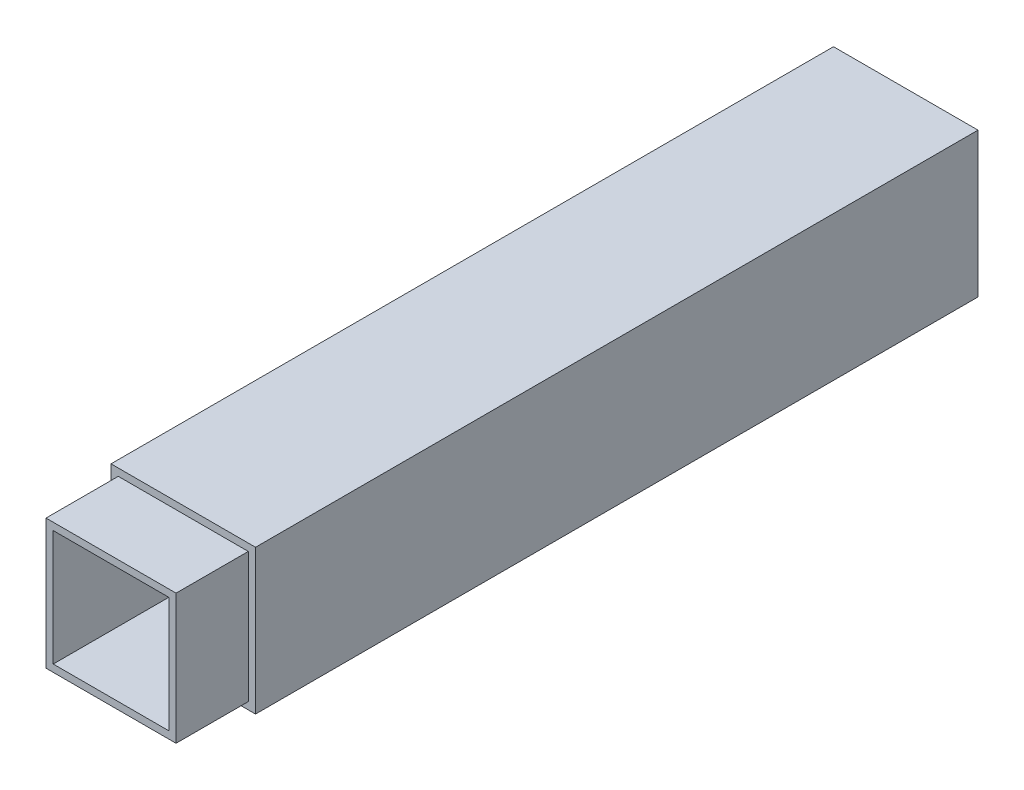
ISO-10303-21;
HEADER;
FILE_DESCRIPTION(('STEP AP214'),'2;1');
FILE_NAME('part.step','',(''),(''),'','','');
FILE_SCHEMA(('AUTOMOTIVE_DESIGN { 1 0 10303 214 1 1 1 1 }'));
ENDSEC;
DATA;
#1=APPLICATION_CONTEXT('core data for automotive mechanical design processes');
#2=APPLICATION_PROTOCOL_DEFINITION('international standard','automotive_design',2000,#1);
#3=PRODUCT_CONTEXT('',#1,'mechanical');
#4=PRODUCT('Part','Part','',(#3));
#5=PRODUCT_RELATED_PRODUCT_CATEGORY('part','',(#4));
#6=PRODUCT_DEFINITION_FORMATION('','',#4);
#7=PRODUCT_DEFINITION_CONTEXT('part definition',#1,'design');
#8=PRODUCT_DEFINITION('design','',#6,#7);
#9=PRODUCT_DEFINITION_SHAPE('','',#8);
#10=(LENGTH_UNIT() NAMED_UNIT(*) SI_UNIT(.MILLI.,.METRE.));
#11=(NAMED_UNIT(*) PLANE_ANGLE_UNIT() SI_UNIT($,.RADIAN.));
#12=(NAMED_UNIT(*) SI_UNIT($,.STERADIAN.) SOLID_ANGLE_UNIT());
#13=UNCERTAINTY_MEASURE_WITH_UNIT(LENGTH_MEASURE(1.E-05),#10,'distance_accuracy_value','');
#14=(GEOMETRIC_REPRESENTATION_CONTEXT(3) GLOBAL_UNCERTAINTY_ASSIGNED_CONTEXT((#13)) GLOBAL_UNIT_ASSIGNED_CONTEXT((#10,
#11,#12)) REPRESENTATION_CONTEXT('',''));
#15=CARTESIAN_POINT('',(0.,0.,0.));
#16=DIRECTION('',(0.,0.,1.));
#17=DIRECTION('',(1.,0.,0.));
#18=AXIS2_PLACEMENT_3D('',#15,#16,#17);
#19=CARTESIAN_POINT('',(-10.,10.,100.));
#20=DIRECTION('',(1.,0.,0.));
#21=DIRECTION('',(0.,1.,0.));
#22=AXIS2_PLACEMENT_3D('',#19,#20,#21);
#23=PLANE('',#22);
#24=DIRECTION('',(0.,-1.,0.));
#25=VECTOR('',#24,1.);
#26=CARTESIAN_POINT('',(-10.,10.,0.));
#27=LINE('',#26,#25);
#28=CARTESIAN_POINT('',(-10.,10.,0.));
#29=VERTEX_POINT('',#28);
#30=CARTESIAN_POINT('',(-10.,-10.,0.));
#31=VERTEX_POINT('',#30);
#32=EDGE_CURVE('E220',#29,#31,#27,.T.);
#33=ORIENTED_EDGE('',*,*,#32,.T.);
#34=DIRECTION('',(0.,0.,-1.));
#35=VECTOR('',#34,1.);
#36=CARTESIAN_POINT('',(-10.,-10.,100.));
#37=LINE('',#36,#35);
#38=CARTESIAN_POINT('',(-10.,-10.,100.));
#39=VERTEX_POINT('',#38);
#40=EDGE_CURVE('E11',#39,#31,#37,.T.);
#41=ORIENTED_EDGE('',*,*,#40,.F.);
#42=DIRECTION('',(0.,-1.,0.));
#43=VECTOR('',#42,1.);
#44=CARTESIAN_POINT('',(-10.,10.,100.));
#45=LINE('',#44,#43);
#46=CARTESIAN_POINT('',(-10.,10.,100.));
#47=VERTEX_POINT('',#46);
#48=EDGE_CURVE('E221',#47,#39,#45,.T.);
#49=ORIENTED_EDGE('',*,*,#48,.F.);
#50=DIRECTION('',(0.,0.,-1.));
#51=VECTOR('',#50,1.);
#52=CARTESIAN_POINT('',(-10.,10.,100.));
#53=LINE('',#52,#51);
#54=EDGE_CURVE('E235',#47,#29,#53,.T.);
#55=ORIENTED_EDGE('',*,*,#54,.T.);
#56=EDGE_LOOP('',(#33,#41,#49,#55));
#57=FACE_BOUND('',#56,.T.);
#58=ADVANCED_FACE('F39',(#57),#23,.F.);
#59=CARTESIAN_POINT('',(-10.,-10.,100.));
#60=DIRECTION('',(0.,1.,0.));
#61=DIRECTION('',(0.,0.,1.));
#62=AXIS2_PLACEMENT_3D('',#59,#60,#61);
#63=PLANE('',#62);
#64=DIRECTION('',(1.,0.,0.));
#65=VECTOR('',#64,1.);
#66=CARTESIAN_POINT('',(-10.,-10.,0.));
#67=LINE('',#66,#65);
#68=CARTESIAN_POINT('',(10.,-10.,0.));
#69=VERTEX_POINT('',#68);
#70=EDGE_CURVE('E239',#31,#69,#67,.T.);
#71=ORIENTED_EDGE('',*,*,#70,.T.);
#72=DIRECTION('',(0.,0.,-1.));
#73=VECTOR('',#72,1.);
#74=CARTESIAN_POINT('',(10.,-10.,100.));
#75=LINE('',#74,#73);
#76=CARTESIAN_POINT('',(10.,-10.,100.));
#77=VERTEX_POINT('',#76);
#78=EDGE_CURVE('E47',#77,#69,#75,.T.);
#79=ORIENTED_EDGE('',*,*,#78,.F.);
#80=DIRECTION('',(1.,0.,0.));
#81=VECTOR('',#80,1.);
#82=CARTESIAN_POINT('',(-10.,-10.,100.));
#83=LINE('',#82,#81);
#84=EDGE_CURVE('E225',#39,#77,#83,.T.);
#85=ORIENTED_EDGE('',*,*,#84,.F.);
#86=ORIENTED_EDGE('',*,*,#40,.T.);
#87=EDGE_LOOP('',(#71,#79,#85,#86));
#88=FACE_BOUND('',#87,.T.);
#89=ADVANCED_FACE('F275',(#88),#63,.F.);
#90=CARTESIAN_POINT('',(10.,10.,100.));
#91=DIRECTION('',(-1.,0.,0.));
#92=DIRECTION('',(0.,-1.,0.));
#93=AXIS2_PLACEMENT_3D('',#90,#91,#92);
#94=PLANE('',#93);
#95=DIRECTION('',(0.,1.,0.));
#96=VECTOR('',#95,1.);
#97=CARTESIAN_POINT('',(10.,10.,0.));
#98=LINE('',#97,#96);
#99=CARTESIAN_POINT('',(10.,10.,0.));
#100=VERTEX_POINT('',#99);
#101=EDGE_CURVE('E242',#69,#100,#98,.T.);
#102=ORIENTED_EDGE('',*,*,#101,.T.);
#103=DIRECTION('',(0.,0.,-1.));
#104=VECTOR('',#103,1.);
#105=CARTESIAN_POINT('',(10.,10.,100.));
#106=LINE('',#105,#104);
#107=CARTESIAN_POINT('',(10.,10.,100.));
#108=VERTEX_POINT('',#107);
#109=EDGE_CURVE('E250',#108,#100,#106,.T.);
#110=ORIENTED_EDGE('',*,*,#109,.F.);
#111=DIRECTION('',(0.,1.,0.));
#112=VECTOR('',#111,1.);
#113=CARTESIAN_POINT('',(10.,10.,100.));
#114=LINE('',#113,#112);
#115=EDGE_CURVE('E229',#77,#108,#114,.T.);
#116=ORIENTED_EDGE('',*,*,#115,.F.);
#117=ORIENTED_EDGE('',*,*,#78,.T.);
#118=EDGE_LOOP('',(#102,#110,#116,#117));
#119=FACE_BOUND('',#118,.T.);
#120=ADVANCED_FACE('F259',(#119),#94,.F.);
#121=CARTESIAN_POINT('',(-10.,10.,100.));
#122=DIRECTION('',(0.,-1.,0.));
#123=DIRECTION('',(0.,0.,-1.));
#124=AXIS2_PLACEMENT_3D('',#121,#122,#123);
#125=PLANE('',#124);
#126=DIRECTION('',(-1.,0.,0.));
#127=VECTOR('',#126,1.);
#128=CARTESIAN_POINT('',(-10.,10.,0.));
#129=LINE('',#128,#127);
#130=EDGE_CURVE('E226',#100,#29,#129,.T.);
#131=ORIENTED_EDGE('',*,*,#130,.T.);
#132=ORIENTED_EDGE('',*,*,#54,.F.);
#133=DIRECTION('',(-1.,0.,0.));
#134=VECTOR('',#133,1.);
#135=CARTESIAN_POINT('',(-10.,10.,100.));
#136=LINE('',#135,#134);
#137=EDGE_CURVE('E232',#108,#47,#136,.T.);
#138=ORIENTED_EDGE('',*,*,#137,.F.);
#139=ORIENTED_EDGE('',*,*,#109,.T.);
#140=EDGE_LOOP('',(#131,#132,#138,#139));
#141=FACE_BOUND('',#140,.T.);
#142=ADVANCED_FACE('F268',(#141),#125,.F.);
#143=CARTESIAN_POINT('',(0.,0.,100.));
#144=DIRECTION('',(0.,0.,1.));
#145=DIRECTION('',(1.,0.,0.));
#146=AXIS2_PLACEMENT_3D('',#143,#144,#145);
#147=PLANE('',#146);
#148=DIRECTION('',(0.,-1.,0.));
#149=VECTOR('',#148,1.);
#150=CARTESIAN_POINT('',(-9.,9.,100.));
#151=LINE('',#150,#149);
#152=CARTESIAN_POINT('',(-9.,9.,100.));
#153=VERTEX_POINT('',#152);
#154=CARTESIAN_POINT('',(-9.,-9.,100.));
#155=VERTEX_POINT('',#154);
#156=EDGE_CURVE('E62',#153,#155,#151,.T.);
#157=ORIENTED_EDGE('',*,*,#156,.F.);
#158=DIRECTION('',(-1.,0.,0.));
#159=VECTOR('',#158,1.);
#160=CARTESIAN_POINT('',(-9.,9.,100.));
#161=LINE('',#160,#159);
#162=CARTESIAN_POINT('',(9.,9.,100.));
#163=VERTEX_POINT('',#162);
#164=EDGE_CURVE('E183',#163,#153,#161,.T.);
#165=ORIENTED_EDGE('',*,*,#164,.F.);
#166=DIRECTION('',(0.,1.,0.));
#167=VECTOR('',#166,1.);
#168=CARTESIAN_POINT('',(9.,9.,100.));
#169=LINE('',#168,#167);
#170=CARTESIAN_POINT('',(9.,-9.,100.));
#171=VERTEX_POINT('',#170);
#172=EDGE_CURVE('E199',#171,#163,#169,.T.);
#173=ORIENTED_EDGE('',*,*,#172,.F.);
#174=DIRECTION('',(1.,0.,0.));
#175=VECTOR('',#174,1.);
#176=CARTESIAN_POINT('',(-9.,-9.,100.));
#177=LINE('',#176,#175);
#178=EDGE_CURVE('E195',#155,#171,#177,.T.);
#179=ORIENTED_EDGE('',*,*,#178,.F.);
#180=EDGE_LOOP('',(#157,#165,#173,#179));
#181=FACE_BOUND('',#180,.T.);
#182=ORIENTED_EDGE('',*,*,#48,.T.);
#183=ORIENTED_EDGE('',*,*,#84,.T.);
#184=ORIENTED_EDGE('',*,*,#115,.T.);
#185=ORIENTED_EDGE('',*,*,#137,.T.);
#186=EDGE_LOOP('',(#182,#183,#184,#185));
#187=FACE_BOUND('',#186,.T.);
#188=ADVANCED_FACE('F274',(#181,#187),#147,.T.);
#189=CARTESIAN_POINT('',(0.,0.,0.));
#190=DIRECTION('',(0.,0.,1.));
#191=DIRECTION('',(1.,0.,0.));
#192=AXIS2_PLACEMENT_3D('',#189,#190,#191);
#193=PLANE('',#192);
#194=ORIENTED_EDGE('',*,*,#32,.F.);
#195=ORIENTED_EDGE('',*,*,#130,.F.);
#196=ORIENTED_EDGE('',*,*,#101,.F.);
#197=ORIENTED_EDGE('',*,*,#70,.F.);
#198=EDGE_LOOP('',(#194,#195,#196,#197));
#199=FACE_BOUND('',#198,.T.);
#200=ADVANCED_FACE('F265',(#199),#193,.F.);
#201=CARTESIAN_POINT('',(-9.,9.,110.));
#202=DIRECTION('',(1.,0.,0.));
#203=DIRECTION('',(0.,1.,0.));
#204=AXIS2_PLACEMENT_3D('',#201,#202,#203);
#205=PLANE('',#204);
#206=ORIENTED_EDGE('',*,*,#156,.T.);
#207=DIRECTION('',(0.,0.,-1.));
#208=VECTOR('',#207,1.);
#209=CARTESIAN_POINT('',(-9.,-9.,110.));
#210=LINE('',#209,#208);
#211=CARTESIAN_POINT('',(-9.,-9.,110.));
#212=VERTEX_POINT('',#211);
#213=EDGE_CURVE('E216',#212,#155,#210,.T.);
#214=ORIENTED_EDGE('',*,*,#213,.F.);
#215=DIRECTION('',(0.,-1.,0.));
#216=VECTOR('',#215,1.);
#217=CARTESIAN_POINT('',(-9.,9.,110.));
#218=LINE('',#217,#216);
#219=CARTESIAN_POINT('',(-9.,9.,110.));
#220=VERTEX_POINT('',#219);
#221=EDGE_CURVE('E178',#220,#212,#218,.T.);
#222=ORIENTED_EDGE('',*,*,#221,.F.);
#223=DIRECTION('',(0.,0.,-1.));
#224=VECTOR('',#223,1.);
#225=CARTESIAN_POINT('',(-9.,9.,110.));
#226=LINE('',#225,#224);
#227=EDGE_CURVE('E192',#220,#153,#226,.T.);
#228=ORIENTED_EDGE('',*,*,#227,.T.);
#229=EDGE_LOOP('',(#206,#214,#222,#228));
#230=FACE_BOUND('',#229,.T.);
#231=ADVANCED_FACE('F287',(#230),#205,.F.);
#232=CARTESIAN_POINT('',(-9.,-9.,110.));
#233=DIRECTION('',(0.,1.,0.));
#234=DIRECTION('',(0.,0.,1.));
#235=AXIS2_PLACEMENT_3D('',#232,#233,#234);
#236=PLANE('',#235);
#237=ORIENTED_EDGE('',*,*,#178,.T.);
#238=DIRECTION('',(0.,0.,-1.));
#239=VECTOR('',#238,1.);
#240=CARTESIAN_POINT('',(9.,-9.,110.));
#241=LINE('',#240,#239);
#242=CARTESIAN_POINT('',(9.,-9.,110.));
#243=VERTEX_POINT('',#242);
#244=EDGE_CURVE('E212',#243,#171,#241,.T.);
#245=ORIENTED_EDGE('',*,*,#244,.F.);
#246=DIRECTION('',(1.,0.,0.));
#247=VECTOR('',#246,1.);
#248=CARTESIAN_POINT('',(-9.,-9.,110.));
#249=LINE('',#248,#247);
#250=EDGE_CURVE('E182',#212,#243,#249,.T.);
#251=ORIENTED_EDGE('',*,*,#250,.F.);
#252=ORIENTED_EDGE('',*,*,#213,.T.);
#253=EDGE_LOOP('',(#237,#245,#251,#252));
#254=FACE_BOUND('',#253,.T.);
#255=ADVANCED_FACE('F292',(#254),#236,.F.);
#256=CARTESIAN_POINT('',(9.,9.,110.));
#257=DIRECTION('',(-1.,0.,0.));
#258=DIRECTION('',(0.,-1.,0.));
#259=AXIS2_PLACEMENT_3D('',#256,#257,#258);
#260=PLANE('',#259);
#261=ORIENTED_EDGE('',*,*,#172,.T.);
#262=DIRECTION('',(0.,0.,-1.));
#263=VECTOR('',#262,1.);
#264=CARTESIAN_POINT('',(9.,9.,110.));
#265=LINE('',#264,#263);
#266=CARTESIAN_POINT('',(9.,9.,110.));
#267=VERTEX_POINT('',#266);
#268=EDGE_CURVE('E208',#267,#163,#265,.T.);
#269=ORIENTED_EDGE('',*,*,#268,.F.);
#270=DIRECTION('',(0.,1.,0.));
#271=VECTOR('',#270,1.);
#272=CARTESIAN_POINT('',(9.,9.,110.));
#273=LINE('',#272,#271);
#274=EDGE_CURVE('E186',#243,#267,#273,.T.);
#275=ORIENTED_EDGE('',*,*,#274,.F.);
#276=ORIENTED_EDGE('',*,*,#244,.T.);
#277=EDGE_LOOP('',(#261,#269,#275,#276));
#278=FACE_BOUND('',#277,.T.);
#279=ADVANCED_FACE('F296',(#278),#260,.F.);
#280=CARTESIAN_POINT('',(-9.,9.,110.));
#281=DIRECTION('',(0.,-1.,0.));
#282=DIRECTION('',(0.,0.,-1.));
#283=AXIS2_PLACEMENT_3D('',#280,#281,#282);
#284=PLANE('',#283);
#285=ORIENTED_EDGE('',*,*,#164,.T.);
#286=ORIENTED_EDGE('',*,*,#227,.F.);
#287=DIRECTION('',(-1.,0.,0.));
#288=VECTOR('',#287,1.);
#289=CARTESIAN_POINT('',(-9.,9.,110.));
#290=LINE('',#289,#288);
#291=EDGE_CURVE('E189',#267,#220,#290,.T.);
#292=ORIENTED_EDGE('',*,*,#291,.F.);
#293=ORIENTED_EDGE('',*,*,#268,.T.);
#294=EDGE_LOOP('',(#285,#286,#292,#293));
#295=FACE_BOUND('',#294,.T.);
#296=ADVANCED_FACE('F300',(#295),#284,.F.);
#297=CARTESIAN_POINT('',(0.,0.,110.));
#298=DIRECTION('',(0.,0.,1.));
#299=DIRECTION('',(1.,0.,0.));
#300=AXIS2_PLACEMENT_3D('',#297,#298,#299);
#301=PLANE('',#300);
#302=DIRECTION('',(0.,-1.,0.));
#303=VECTOR('',#302,1.);
#304=CARTESIAN_POINT('',(-8.,8.,110.));
#305=LINE('',#304,#303);
#306=CARTESIAN_POINT('',(-8.,8.,110.));
#307=VERTEX_POINT('',#306);
#308=CARTESIAN_POINT('',(-8.,-8.,110.));
#309=VERTEX_POINT('',#308);
#310=EDGE_CURVE('E54',#307,#309,#305,.T.);
#311=ORIENTED_EDGE('',*,*,#310,.F.);
#312=DIRECTION('',(-1.,0.,0.));
#313=VECTOR('',#312,1.);
#314=CARTESIAN_POINT('',(-8.,8.,110.));
#315=LINE('',#314,#313);
#316=CARTESIAN_POINT('',(8.,8.,110.));
#317=VERTEX_POINT('',#316);
#318=EDGE_CURVE('E151',#317,#307,#315,.T.);
#319=ORIENTED_EDGE('',*,*,#318,.F.);
#320=DIRECTION('',(0.,1.,0.));
#321=VECTOR('',#320,1.);
#322=CARTESIAN_POINT('',(8.,8.,110.));
#323=LINE('',#322,#321);
#324=CARTESIAN_POINT('',(8.00000000000001,-8.,110.));
#325=VERTEX_POINT('',#324);
#326=EDGE_CURVE('E155',#325,#317,#323,.T.);
#327=ORIENTED_EDGE('',*,*,#326,.F.);
#328=DIRECTION('',(1.,0.,0.));
#329=VECTOR('',#328,1.);
#330=CARTESIAN_POINT('',(-8.,-8.,110.));
#331=LINE('',#330,#329);
#332=EDGE_CURVE('E164',#309,#325,#331,.T.);
#333=ORIENTED_EDGE('',*,*,#332,.F.);
#334=EDGE_LOOP('',(#311,#319,#327,#333));
#335=FACE_BOUND('',#334,.T.);
#336=ORIENTED_EDGE('',*,*,#221,.T.);
#337=ORIENTED_EDGE('',*,*,#250,.T.);
#338=ORIENTED_EDGE('',*,*,#274,.T.);
#339=ORIENTED_EDGE('',*,*,#291,.T.);
#340=EDGE_LOOP('',(#336,#337,#338,#339));
#341=FACE_BOUND('',#340,.T.);
#342=ADVANCED_FACE('F304',(#335,#341),#301,.T.);
#343=CARTESIAN_POINT('',(-8.,8.,9.99999999999999));
#344=DIRECTION('',(-1.,0.,0.));
#345=DIRECTION('',(0.,-1.,0.));
#346=AXIS2_PLACEMENT_3D('',#343,#344,#345);
#347=PLANE('',#346);
#348=ORIENTED_EDGE('',*,*,#310,.T.);
#349=DIRECTION('',(0.,0.,1.));
#350=VECTOR('',#349,1.);
#351=CARTESIAN_POINT('',(-8.,-8.,9.99999999999999));
#352=LINE('',#351,#350);
#353=CARTESIAN_POINT('',(-8.,-8.,9.99999999999999));
#354=VERTEX_POINT('',#353);
#355=EDGE_CURVE('E126',#354,#309,#352,.T.);
#356=ORIENTED_EDGE('',*,*,#355,.F.);
#357=DIRECTION('',(0.,-1.,0.));
#358=VECTOR('',#357,1.);
#359=CARTESIAN_POINT('',(-8.,8.,9.99999999999999));
#360=LINE('',#359,#358);
#361=CARTESIAN_POINT('',(-8.,8.,9.99999999999999));
#362=VERTEX_POINT('',#361);
#363=EDGE_CURVE('E130',#362,#354,#360,.T.);
#364=ORIENTED_EDGE('',*,*,#363,.F.);
#365=DIRECTION('',(0.,0.,1.));
#366=VECTOR('',#365,1.);
#367=CARTESIAN_POINT('',(-8.,8.,9.99999999999999));
#368=LINE('',#367,#366);
#369=EDGE_CURVE('E170',#362,#307,#368,.T.);
#370=ORIENTED_EDGE('',*,*,#369,.T.);
#371=EDGE_LOOP('',(#348,#356,#364,#370));
#372=FACE_BOUND('',#371,.T.);
#373=ADVANCED_FACE('F128',(#372),#347,.F.);
#374=CARTESIAN_POINT('',(-8.,8.,9.99999999999999));
#375=DIRECTION('',(0.,1.,0.));
#376=DIRECTION('',(0.,0.,1.));
#377=AXIS2_PLACEMENT_3D('',#374,#375,#376);
#378=PLANE('',#377);
#379=ORIENTED_EDGE('',*,*,#318,.T.);
#380=ORIENTED_EDGE('',*,*,#369,.F.);
#381=DIRECTION('',(-1.,0.,0.));
#382=VECTOR('',#381,1.);
#383=CARTESIAN_POINT('',(-8.,8.,9.99999999999999));
#384=LINE('',#383,#382);
#385=CARTESIAN_POINT('',(8.,8.,9.99999999999999));
#386=VERTEX_POINT('',#385);
#387=EDGE_CURVE('E137',#386,#362,#384,.T.);
#388=ORIENTED_EDGE('',*,*,#387,.F.);
#389=DIRECTION('',(0.,0.,1.));
#390=VECTOR('',#389,1.);
#391=CARTESIAN_POINT('',(8.,8.,9.99999999999999));
#392=LINE('',#391,#390);
#393=EDGE_CURVE('E173',#386,#317,#392,.T.);
#394=ORIENTED_EDGE('',*,*,#393,.T.);
#395=EDGE_LOOP('',(#379,#380,#388,#394));
#396=FACE_BOUND('',#395,.T.);
#397=ADVANCED_FACE('F311',(#396),#378,.F.);
#398=CARTESIAN_POINT('',(8.,8.,9.99999999999999));
#399=DIRECTION('',(1.,0.,0.));
#400=DIRECTION('',(0.,1.,0.));
#401=AXIS2_PLACEMENT_3D('',#398,#399,#400);
#402=PLANE('',#401);
#403=ORIENTED_EDGE('',*,*,#326,.T.);
#404=ORIENTED_EDGE('',*,*,#393,.F.);
#405=DIRECTION('',(0.,1.,0.));
#406=VECTOR('',#405,1.);
#407=CARTESIAN_POINT('',(8.,8.,9.99999999999999));
#408=LINE('',#407,#406);
#409=CARTESIAN_POINT('',(8.00000000000001,-8.,9.99999999999999));
#410=VERTEX_POINT('',#409);
#411=EDGE_CURVE('E146',#410,#386,#408,.T.);
#412=ORIENTED_EDGE('',*,*,#411,.F.);
#413=DIRECTION('',(0.,0.,1.));
#414=VECTOR('',#413,1.);
#415=CARTESIAN_POINT('',(8.00000000000001,-8.,9.99999999999999));
#416=LINE('',#415,#414);
#417=EDGE_CURVE('E136',#410,#325,#416,.T.);
#418=ORIENTED_EDGE('',*,*,#417,.T.);
#419=EDGE_LOOP('',(#403,#404,#412,#418));
#420=FACE_BOUND('',#419,.T.);
#421=ADVANCED_FACE('F314',(#420),#402,.F.);
#422=CARTESIAN_POINT('',(-8.,-8.,9.99999999999999));
#423=DIRECTION('',(0.,-1.,0.));
#424=DIRECTION('',(0.,0.,-1.));
#425=AXIS2_PLACEMENT_3D('',#422,#423,#424);
#426=PLANE('',#425);
#427=ORIENTED_EDGE('',*,*,#332,.T.);
#428=ORIENTED_EDGE('',*,*,#417,.F.);
#429=DIRECTION('',(1.,0.,0.));
#430=VECTOR('',#429,1.);
#431=CARTESIAN_POINT('',(-8.,-8.,9.99999999999999));
#432=LINE('',#431,#430);
#433=EDGE_CURVE('E140',#354,#410,#432,.T.);
#434=ORIENTED_EDGE('',*,*,#433,.F.);
#435=ORIENTED_EDGE('',*,*,#355,.T.);
#436=EDGE_LOOP('',(#427,#428,#434,#435));
#437=FACE_BOUND('',#436,.T.);
#438=ADVANCED_FACE('F141',(#437),#426,.F.);
#439=CARTESIAN_POINT('',(0.,0.,9.99999999999999));
#440=DIRECTION('',(0.,0.,1.));
#441=DIRECTION('',(1.,0.,0.));
#442=AXIS2_PLACEMENT_3D('',#439,#440,#441);
#443=PLANE('',#442);
#444=ORIENTED_EDGE('',*,*,#363,.T.);
#445=ORIENTED_EDGE('',*,*,#433,.T.);
#446=ORIENTED_EDGE('',*,*,#411,.T.);
#447=ORIENTED_EDGE('',*,*,#387,.T.);
#448=EDGE_LOOP('',(#444,#445,#446,#447));
#449=FACE_BOUND('',#448,.T.);
#450=ADVANCED_FACE('F148',(#449),#443,.T.);
#451=CLOSED_SHELL('',(#58,#89,#120,#142,#188,#200,#231,#255,#279,#296,#342,#373,#397,#421,#438,#450));
#452=MANIFOLD_SOLID_BREP('B2',#451);
#453=ADVANCED_BREP_SHAPE_REPRESENTATION('',(#18,#452),#14);
#454=SHAPE_DEFINITION_REPRESENTATION(#9,#453);
ENDSEC;
END-ISO-10303-21;
